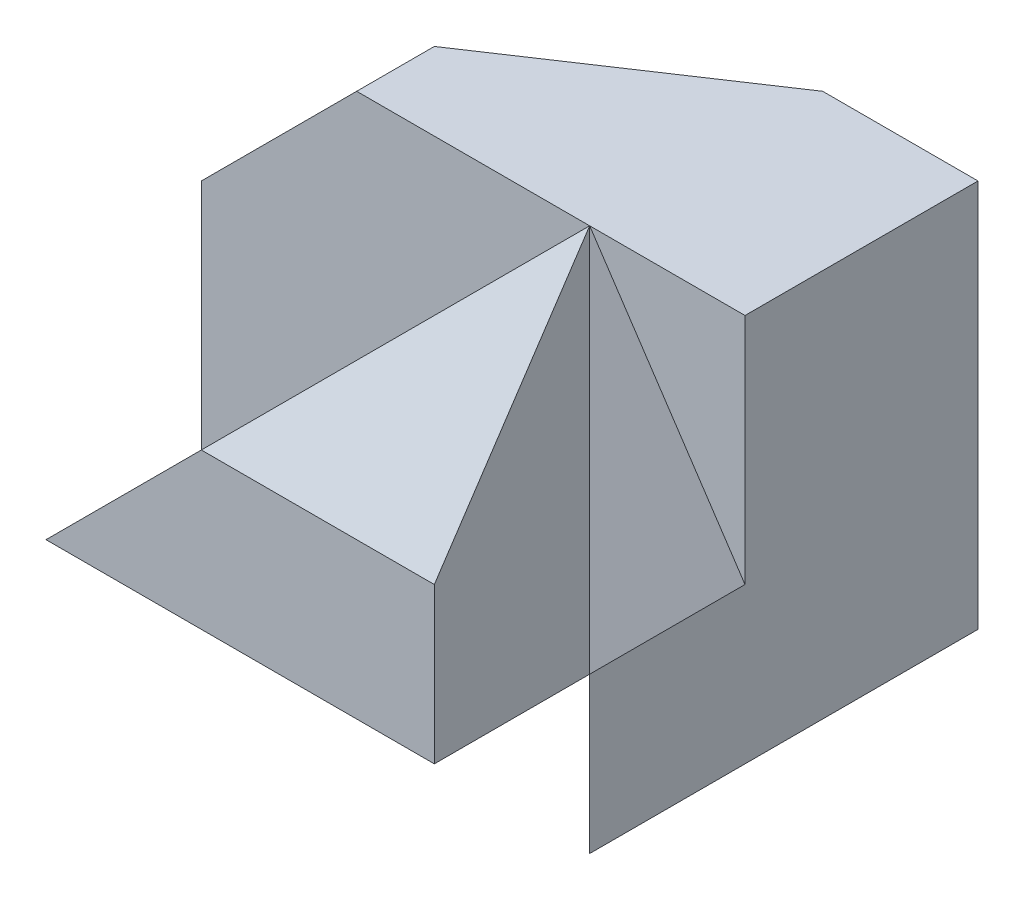
ISO-10303-21;
HEADER;
FILE_DESCRIPTION(('STEP AP214'),'2;1');
FILE_NAME('part.step','',(''),(''),'','','');
FILE_SCHEMA(('AUTOMOTIVE_DESIGN { 1 0 10303 214 1 1 1 1 }'));
ENDSEC;
DATA;
#1=APPLICATION_CONTEXT('core data for automotive mechanical design processes');
#2=APPLICATION_PROTOCOL_DEFINITION('international standard','automotive_design',2000,#1);
#3=PRODUCT_CONTEXT('',#1,'mechanical');
#4=PRODUCT('Part','Part','',(#3));
#5=PRODUCT_RELATED_PRODUCT_CATEGORY('part','',(#4));
#6=PRODUCT_DEFINITION_FORMATION('','',#4);
#7=PRODUCT_DEFINITION_CONTEXT('part definition',#1,'design');
#8=PRODUCT_DEFINITION('design','',#6,#7);
#9=PRODUCT_DEFINITION_SHAPE('','',#8);
#10=(LENGTH_UNIT() NAMED_UNIT(*) SI_UNIT(.MILLI.,.METRE.));
#11=(NAMED_UNIT(*) PLANE_ANGLE_UNIT() SI_UNIT($,.RADIAN.));
#12=(NAMED_UNIT(*) SI_UNIT($,.STERADIAN.) SOLID_ANGLE_UNIT());
#13=UNCERTAINTY_MEASURE_WITH_UNIT(LENGTH_MEASURE(1.E-05),#10,'distance_accuracy_value','');
#14=(GEOMETRIC_REPRESENTATION_CONTEXT(3) GLOBAL_UNCERTAINTY_ASSIGNED_CONTEXT((#13)) GLOBAL_UNIT_ASSIGNED_CONTEXT((#10,
#11,#12)) REPRESENTATION_CONTEXT('',''));
#15=CARTESIAN_POINT('',(0.,0.,0.));
#16=DIRECTION('',(0.,0.,1.));
#17=DIRECTION('',(1.,0.,0.));
#18=AXIS2_PLACEMENT_3D('',#15,#16,#17);
#19=CARTESIAN_POINT('',(20.,0.,0.));
#20=DIRECTION('',(0.,-0.554700196225229,0.832050294337844));
#21=DIRECTION('',(0.,-0.832050294337844,-0.554700196225229));
#22=AXIS2_PLACEMENT_3D('',#19,#20,#21);
#23=PLANE('',#22);
#24=DIRECTION('',(-1.,0.,0.));
#25=VECTOR('',#24,1.);
#26=CARTESIAN_POINT('',(20.,30.,20.));
#27=LINE('',#26,#25);
#28=CARTESIAN_POINT('',(20.,30.,20.));
#29=VERTEX_POINT('',#28);
#30=CARTESIAN_POINT('',(0.,30.,20.));
#31=VERTEX_POINT('',#30);
#32=EDGE_CURVE('E301',#29,#31,#27,.T.);
#33=ORIENTED_EDGE('',*,*,#32,.F.);
#34=CARTESIAN_POINT('',(20.,5.84616321716092E-05,-2.76923375251665E-05));
#35=DIRECTION('',(0.,0.832049440949972,0.554701476304902));
#36=VECTOR('',#35,1.);
#37=LINE('',#34,#36);
#38=CARTESIAN_POINT('',(19.9999999998504,0.,6.00005553251688E-05));
#39=VERTEX_POINT('',#38);
#40=EDGE_CURVE('E207',#39,#29,#37,.T.);
#41=ORIENTED_EDGE('',*,*,#40,.F.);
#42=CARTESIAN_POINT('',(4.72295226169299,0.,1.41689879204487E-05));
#43=DIRECTION('',(0.9999999999955,0.,3.0000277663376E-06));
#44=VECTOR('',#43,1.);
#45=LINE('',#42,#44);
#46=CARTESIAN_POINT('',(4.72295226171092,1.62768280284415E-06,8.18518395397015E-06));
#47=VERTEX_POINT('',#46);
#48=EDGE_CURVE('E45',#47,#39,#45,.T.);
#49=ORIENTED_EDGE('',*,*,#48,.F.);
#50=DIRECTION('',(-0.999999999998615,-1.3846148165639E-06,-9.23076544375934E-07));
#51=VECTOR('',#50,1.);
#52=CARTESIAN_POINT('',(1.1094003924198E-05,1.53601090180366E-11,1.02418074021671E-11));
#53=LINE('',#52,#51);
#54=CARTESIAN_POINT('',(0.,0.,0.));
#55=VERTEX_POINT('',#54);
#56=EDGE_CURVE('E234',#47,#55,#53,.T.);
#57=ORIENTED_EDGE('',*,*,#56,.T.);
#58=DIRECTION('',(0.,0.832050294337844,0.554700196225229));
#59=VECTOR('',#58,1.);
#60=CARTESIAN_POINT('',(0.,0.,0.));
#61=LINE('',#60,#59);
#62=EDGE_CURVE('E289',#55,#31,#61,.T.);
#63=ORIENTED_EDGE('',*,*,#62,.T.);
#64=EDGE_LOOP('',(#33,#41,#49,#57,#63));
#65=FACE_BOUND('',#64,.T.);
#66=ADVANCED_FACE('F36',(#65),#23,.F.);
#67=CARTESIAN_POINT('',(70.,0.,50.));
#68=DIRECTION('',(0.,1.,0.));
#69=DIRECTION('',(0.,0.,1.));
#70=AXIS2_PLACEMENT_3D('',#67,#68,#69);
#71=PLANE('',#70);
#72=ORIENTED_EDGE('',*,*,#48,.T.);
#73=DIRECTION('',(1.,0.,0.));
#74=VECTOR('',#73,1.);
#75=CARTESIAN_POINT('',(70.,0.,0.));
#76=LINE('',#75,#74);
#77=CARTESIAN_POINT('',(70.,0.,0.));
#78=VERTEX_POINT('',#77);
#79=EDGE_CURVE('E305',#39,#78,#76,.T.);
#80=ORIENTED_EDGE('',*,*,#79,.T.);
#81=DIRECTION('',(0.,0.,-1.));
#82=VECTOR('',#81,1.);
#83=CARTESIAN_POINT('',(70.,0.,50.));
#84=LINE('',#83,#82);
#85=CARTESIAN_POINT('',(70.,0.,50.));
#86=VERTEX_POINT('',#85);
#87=EDGE_CURVE('E742',#86,#78,#84,.T.);
#88=ORIENTED_EDGE('',*,*,#87,.F.);
#89=DIRECTION('',(0.707106781186548,0.,0.707106781186548));
#90=VECTOR('',#89,1.);
#91=CARTESIAN_POINT('',(70.,0.,50.));
#92=LINE('',#91,#90);
#93=CARTESIAN_POINT('',(50.,0.,30.));
#94=VERTEX_POINT('',#93);
#95=EDGE_CURVE('E338',#94,#86,#92,.T.);
#96=ORIENTED_EDGE('',*,*,#95,.F.);
#97=DIRECTION('',(0.,0.,1.));
#98=VECTOR('',#97,1.);
#99=CARTESIAN_POINT('',(50.,0.,40.));
#100=LINE('',#99,#98);
#101=CARTESIAN_POINT('',(50.,0.,50.));
#102=VERTEX_POINT('',#101);
#103=EDGE_CURVE('E343',#94,#102,#100,.T.);
#104=ORIENTED_EDGE('',*,*,#103,.T.);
#105=DIRECTION('',(-1.,0.,0.));
#106=VECTOR('',#105,1.);
#107=CARTESIAN_POINT('',(30.,0.,50.));
#108=LINE('',#107,#106);
#109=CARTESIAN_POINT('',(0.,0.,50.));
#110=VERTEX_POINT('',#109);
#111=EDGE_CURVE('E346',#102,#110,#108,.T.);
#112=ORIENTED_EDGE('',*,*,#111,.T.);
#113=DIRECTION('',(0.,0.,1.));
#114=VECTOR('',#113,1.);
#115=CARTESIAN_POINT('',(0.,0.,21.));
#116=LINE('',#115,#114);
#117=CARTESIAN_POINT('',(0.,0.,30.));
#118=VERTEX_POINT('',#117);
#119=EDGE_CURVE('E351',#118,#110,#116,.T.);
#120=ORIENTED_EDGE('',*,*,#119,.F.);
#121=DIRECTION('',(0.,0.,-1.));
#122=VECTOR('',#121,1.);
#123=CARTESIAN_POINT('',(0.,0.,50.));
#124=LINE('',#123,#122);
#125=EDGE_CURVE('E361',#118,#55,#124,.T.);
#126=ORIENTED_EDGE('',*,*,#125,.T.);
#127=ORIENTED_EDGE('',*,*,#56,.F.);
#128=EDGE_LOOP('',(#72,#80,#88,#96,#104,#112,#120,#126,#127));
#129=FACE_BOUND('',#128,.T.);
#130=ADVANCED_FACE('F186',(#129),#71,.F.);
#131=CARTESIAN_POINT('',(15.3846153846154,40.,23.0769230769231));
#132=DIRECTION('',(0.554700196225229,0.,0.832050294337844));
#133=DIRECTION('',(0.832050294337844,0.,-0.554700196225229));
#134=AXIS2_PLACEMENT_3D('',#131,#132,#133);
#135=PLANE('',#134);
#136=DIRECTION('',(0.,1.,0.));
#137=VECTOR('',#136,1.);
#138=CARTESIAN_POINT('',(50.,40.,0.));
#139=LINE('',#138,#137);
#140=CARTESIAN_POINT('',(50.,0.0001,0.));
#141=VERTEX_POINT('',#140);
#142=CARTESIAN_POINT('',(50.,50.,0.));
#143=VERTEX_POINT('',#142);
#144=EDGE_CURVE('E245',#141,#143,#139,.T.);
#145=ORIENTED_EDGE('',*,*,#144,.F.);
#146=DIRECTION('',(-0.63960302125191,0.63960088924184,0.42640201416794));
#147=VECTOR('',#146,1.);
#148=CARTESIAN_POINT('',(50.,0.0001,0.));
#149=LINE('',#148,#147);
#150=EDGE_CURVE('E367',#141,#29,#149,.T.);
#151=ORIENTED_EDGE('',*,*,#150,.T.);
#152=DIRECTION('',(0.,1.,0.));
#153=VECTOR('',#152,1.);
#154=CARTESIAN_POINT('',(20.,30.,20.));
#155=LINE('',#154,#153);
#156=CARTESIAN_POINT('',(20.,50.,20.));
#157=VERTEX_POINT('',#156);
#158=EDGE_CURVE('E311',#29,#157,#155,.T.);
#159=ORIENTED_EDGE('',*,*,#158,.T.);
#160=DIRECTION('',(0.832050294337844,0.,-0.554700196225229));
#161=VECTOR('',#160,1.);
#162=CARTESIAN_POINT('',(15.3846153846154,50.,23.0769230769231));
#163=LINE('',#162,#161);
#164=EDGE_CURVE('E374',#157,#143,#163,.T.);
#165=ORIENTED_EDGE('',*,*,#164,.T.);
#166=EDGE_LOOP('',(#145,#151,#159,#165));
#167=FACE_BOUND('',#166,.T.);
#168=ADVANCED_FACE('F405',(#167),#135,.F.);
#169=CARTESIAN_POINT('',(50.,50.,20.));
#170=DIRECTION('',(-0.832050294337843,-0.55470019622523,0.));
#171=DIRECTION('',(0.55470019622523,-0.832050294337843,0.));
#172=AXIS2_PLACEMENT_3D('',#169,#170,#171);
#173=PLANE('',#172);
#174=DIRECTION('',(0.55470019622523,-0.832050294337843,0.));
#175=VECTOR('',#174,1.);
#176=CARTESIAN_POINT('',(50.,50.,29.999));
#177=LINE('',#176,#175);
#178=CARTESIAN_POINT('',(50.,50.,29.999));
#179=VERTEX_POINT('',#178);
#180=CARTESIAN_POINT('',(70.,20.,29.999));
#181=VERTEX_POINT('',#180);
#182=EDGE_CURVE('E335',#179,#181,#177,.T.);
#183=ORIENTED_EDGE('',*,*,#182,.F.);
#184=DIRECTION('',(0.,0.,1.));
#185=VECTOR('',#184,1.);
#186=CARTESIAN_POINT('',(50.,50.,20.));
#187=LINE('',#186,#185);
#188=CARTESIAN_POINT('',(50.,50.,30.));
#189=VERTEX_POINT('',#188);
#190=EDGE_CURVE('E357',#179,#189,#187,.T.);
#191=ORIENTED_EDGE('',*,*,#190,.T.);
#192=DIRECTION('',(-0.485071250072666,0.727606875108999,-0.485071250072666));
#193=VECTOR('',#192,1.);
#194=CARTESIAN_POINT('',(59.4117647058824,35.8823529411765,39.4117647058824));
#195=LINE('',#194,#193);
#196=CARTESIAN_POINT('',(70.,20.,50.));
#197=VERTEX_POINT('',#196);
#198=EDGE_CURVE('E731',#197,#189,#195,.T.);
#199=ORIENTED_EDGE('',*,*,#198,.F.);
#200=DIRECTION('',(0.,0.,1.));
#201=VECTOR('',#200,1.);
#202=CARTESIAN_POINT('',(70.,20.,20.));
#203=LINE('',#202,#201);
#204=EDGE_CURVE('E737',#181,#197,#203,.T.);
#205=ORIENTED_EDGE('',*,*,#204,.F.);
#206=EDGE_LOOP('',(#183,#191,#199,#205));
#207=FACE_BOUND('',#206,.T.);
#208=ADVANCED_FACE('F411',(#207),#173,.F.);
#209=CARTESIAN_POINT('',(20.,20.,21.));
#210=DIRECTION('',(-0.707106781186547,0.707106781186547,0.));
#211=DIRECTION('',(-0.707106781186547,-0.707106781186548,0.));
#212=AXIS2_PLACEMENT_3D('',#209,#210,#211);
#213=PLANE('',#212);
#214=DIRECTION('',(-0.639602149066831,-0.639602149066831,0.426401432711221));
#215=VECTOR('',#214,1.);
#216=CARTESIAN_POINT('',(31.8636363636364,31.8636363636364,42.0909090909091));
#217=LINE('',#216,#215);
#218=CARTESIAN_POINT('',(20.,20.,50.));
#219=VERTEX_POINT('',#218);
#220=EDGE_CURVE('E319',#189,#219,#217,.T.);
#221=ORIENTED_EDGE('',*,*,#220,.F.);
#222=DIRECTION('',(-0.707106781186547,-0.707106781186548,0.));
#223=VECTOR('',#222,1.);
#224=CARTESIAN_POINT('',(30.,30.,30.));
#225=LINE('',#224,#223);
#226=EDGE_CURVE('E355',#189,#118,#225,.T.);
#227=ORIENTED_EDGE('',*,*,#226,.T.);
#228=ORIENTED_EDGE('',*,*,#119,.T.);
#229=DIRECTION('',(-0.707106781186548,-0.707106781186548,0.));
#230=VECTOR('',#229,1.);
#231=CARTESIAN_POINT('',(20.,20.,50.));
#232=LINE('',#231,#230);
#233=EDGE_CURVE('E347',#219,#110,#232,.T.);
#234=ORIENTED_EDGE('',*,*,#233,.F.);
#235=EDGE_LOOP('',(#221,#227,#228,#234));
#236=FACE_BOUND('',#235,.T.);
#237=ADVANCED_FACE('F414',(#236),#213,.T.);
#238=CARTESIAN_POINT('',(70.,50.,50.));
#239=DIRECTION('',(-1.,0.,0.));
#240=DIRECTION('',(0.,0.,1.));
#241=AXIS2_PLACEMENT_3D('',#238,#239,#240);
#242=PLANE('',#241);
#243=DIRECTION('',(0.,0.,-1.));
#244=VECTOR('',#243,1.);
#245=CARTESIAN_POINT('',(70.,50.,50.));
#246=LINE('',#245,#244);
#247=CARTESIAN_POINT('',(70.,50.,29.999));
#248=VERTEX_POINT('',#247);
#249=CARTESIAN_POINT('',(70.,50.,0.));
#250=VERTEX_POINT('',#249);
#251=EDGE_CURVE('E747',#248,#250,#246,.T.);
#252=ORIENTED_EDGE('',*,*,#251,.F.);
#253=DIRECTION('',(0.,-1.,0.));
#254=VECTOR('',#253,1.);
#255=CARTESIAN_POINT('',(70.,50.,29.999));
#256=LINE('',#255,#254);
#257=EDGE_CURVE('E354',#248,#181,#256,.T.);
#258=ORIENTED_EDGE('',*,*,#257,.T.);
#259=ORIENTED_EDGE('',*,*,#204,.T.);
#260=DIRECTION('',(0.,-1.,0.));
#261=VECTOR('',#260,1.);
#262=CARTESIAN_POINT('',(70.,50.,50.));
#263=LINE('',#262,#261);
#264=EDGE_CURVE('E739',#197,#86,#263,.T.);
#265=ORIENTED_EDGE('',*,*,#264,.T.);
#266=ORIENTED_EDGE('',*,*,#87,.T.);
#267=DIRECTION('',(0.,1.,0.));
#268=VECTOR('',#267,1.);
#269=CARTESIAN_POINT('',(70.,50.,0.));
#270=LINE('',#269,#268);
#271=EDGE_CURVE('E292',#78,#250,#270,.T.);
#272=ORIENTED_EDGE('',*,*,#271,.T.);
#273=EDGE_LOOP('',(#252,#258,#259,#265,#266,#272));
#274=FACE_BOUND('',#273,.T.);
#275=ADVANCED_FACE('F264',(#274),#242,.F.);
#276=CARTESIAN_POINT('',(0.,0.,50.));
#277=DIRECTION('',(1.,0.,0.));
#278=DIRECTION('',(0.,0.,-1.));
#279=AXIS2_PLACEMENT_3D('',#276,#277,#278);
#280=PLANE('',#279);
#281=ORIENTED_EDGE('',*,*,#62,.F.);
#282=ORIENTED_EDGE('',*,*,#125,.F.);
#283=DIRECTION('',(0.,1.,0.));
#284=VECTOR('',#283,1.);
#285=CARTESIAN_POINT('',(0.,50.,30.));
#286=LINE('',#285,#284);
#287=CARTESIAN_POINT('',(0.,30.,30.));
#288=VERTEX_POINT('',#287);
#289=EDGE_CURVE('E291',#118,#288,#286,.T.);
#290=ORIENTED_EDGE('',*,*,#289,.T.);
#291=DIRECTION('',(0.,0.,1.));
#292=VECTOR('',#291,1.);
#293=CARTESIAN_POINT('',(0.,30.,20.));
#294=LINE('',#293,#292);
#295=EDGE_CURVE('E294',#31,#288,#294,.T.);
#296=ORIENTED_EDGE('',*,*,#295,.F.);
#297=EDGE_LOOP('',(#281,#282,#290,#296));
#298=FACE_BOUND('',#297,.T.);
#299=ADVANCED_FACE('F260',(#298),#280,.F.);
#300=CARTESIAN_POINT('',(0.,0.,50.));
#301=DIRECTION('',(0.,0.,-1.));
#302=DIRECTION('',(-1.,0.,0.));
#303=AXIS2_PLACEMENT_3D('',#300,#301,#302);
#304=PLANE('',#303);
#305=ORIENTED_EDGE('',*,*,#233,.T.);
#306=ORIENTED_EDGE('',*,*,#111,.F.);
#307=DIRECTION('',(0.,-1.,0.));
#308=VECTOR('',#307,1.);
#309=CARTESIAN_POINT('',(50.,0.,50.));
#310=LINE('',#309,#308);
#311=CARTESIAN_POINT('',(50.,20.,50.));
#312=VERTEX_POINT('',#311);
#313=EDGE_CURVE('E341',#312,#102,#310,.T.);
#314=ORIENTED_EDGE('',*,*,#313,.F.);
#315=DIRECTION('',(1.,0.,0.));
#316=VECTOR('',#315,1.);
#317=CARTESIAN_POINT('',(50.,20.,50.));
#318=LINE('',#317,#316);
#319=EDGE_CURVE('E317',#219,#312,#318,.T.);
#320=ORIENTED_EDGE('',*,*,#319,.F.);
#321=EDGE_LOOP('',(#305,#306,#314,#320));
#322=FACE_BOUND('',#321,.T.);
#323=ADVANCED_FACE('F190',(#322),#304,.F.);
#324=CARTESIAN_POINT('',(20.,50.,50.));
#325=DIRECTION('',(0.,-1.,0.));
#326=DIRECTION('',(0.,0.,-1.));
#327=AXIS2_PLACEMENT_3D('',#324,#325,#326);
#328=PLANE('',#327);
#329=DIRECTION('',(-1.,0.,0.));
#330=VECTOR('',#329,1.);
#331=CARTESIAN_POINT('',(20.,50.,0.));
#332=LINE('',#331,#330);
#333=EDGE_CURVE('E350',#250,#143,#332,.T.);
#334=ORIENTED_EDGE('',*,*,#333,.T.);
#335=ORIENTED_EDGE('',*,*,#164,.F.);
#336=DIRECTION('',(0.,0.,-1.));
#337=VECTOR('',#336,1.);
#338=CARTESIAN_POINT('',(20.,50.,30.));
#339=LINE('',#338,#337);
#340=CARTESIAN_POINT('',(20.,50.,30.));
#341=VERTEX_POINT('',#340);
#342=EDGE_CURVE('E316',#341,#157,#339,.T.);
#343=ORIENTED_EDGE('',*,*,#342,.F.);
#344=DIRECTION('',(-1.,0.,0.));
#345=VECTOR('',#344,1.);
#346=CARTESIAN_POINT('',(72.,50.,30.));
#347=LINE('',#346,#345);
#348=EDGE_CURVE('E246',#189,#341,#347,.T.);
#349=ORIENTED_EDGE('',*,*,#348,.F.);
#350=ORIENTED_EDGE('',*,*,#190,.F.);
#351=DIRECTION('',(1.,0.,0.));
#352=VECTOR('',#351,1.);
#353=CARTESIAN_POINT('',(50.,50.,29.999));
#354=LINE('',#353,#352);
#355=EDGE_CURVE('E385',#179,#248,#354,.T.);
#356=ORIENTED_EDGE('',*,*,#355,.T.);
#357=ORIENTED_EDGE('',*,*,#251,.T.);
#358=EDGE_LOOP('',(#334,#335,#343,#349,#350,#356,#357));
#359=FACE_BOUND('',#358,.T.);
#360=ADVANCED_FACE('F258',(#359),#328,.F.);
#361=CARTESIAN_POINT('',(0.,0.,0.));
#362=DIRECTION('',(0.,0.,-1.));
#363=DIRECTION('',(-1.,0.,0.));
#364=AXIS2_PLACEMENT_3D('',#361,#362,#363);
#365=PLANE('',#364);
#366=CARTESIAN_POINT('',(20.,3.99999999990225E-05,0.));
#367=DIRECTION('',(0.999999999998,1.99999999994713E-06,0.));
#368=VECTOR('',#367,1.);
#369=LINE('',#366,#368);
#370=EDGE_CURVE('E242',#39,#141,#369,.T.);
#371=ORIENTED_EDGE('',*,*,#370,.T.);
#372=ORIENTED_EDGE('',*,*,#144,.T.);
#373=ORIENTED_EDGE('',*,*,#333,.F.);
#374=ORIENTED_EDGE('',*,*,#271,.F.);
#375=ORIENTED_EDGE('',*,*,#79,.F.);
#376=EDGE_LOOP('',(#371,#372,#373,#374,#375));
#377=FACE_BOUND('',#376,.T.);
#378=ADVANCED_FACE('F249',(#377),#365,.T.);
#379=CARTESIAN_POINT('',(10.,50.,30.));
#380=DIRECTION('',(0.,0.,1.));
#381=DIRECTION('',(0.,-1.,0.));
#382=AXIS2_PLACEMENT_3D('',#379,#380,#381);
#383=PLANE('',#382);
#384=ORIENTED_EDGE('',*,*,#226,.F.);
#385=ORIENTED_EDGE('',*,*,#348,.T.);
#386=DIRECTION('',(0.707106781186548,0.707106781186548,0.));
#387=VECTOR('',#386,1.);
#388=CARTESIAN_POINT('',(-15.,15.,30.));
#389=LINE('',#388,#387);
#390=EDGE_CURVE('E300',#288,#341,#389,.T.);
#391=ORIENTED_EDGE('',*,*,#390,.F.);
#392=ORIENTED_EDGE('',*,*,#289,.F.);
#393=EDGE_LOOP('',(#384,#385,#391,#392));
#394=FACE_BOUND('',#393,.T.);
#395=ADVANCED_FACE('F188',(#394),#383,.T.);
#396=CARTESIAN_POINT('',(50.,0.,40.));
#397=DIRECTION('',(-1.,0.,0.));
#398=DIRECTION('',(0.,-1.,0.));
#399=AXIS2_PLACEMENT_3D('',#396,#397,#398);
#400=PLANE('',#399);
#401=ORIENTED_EDGE('',*,*,#103,.F.);
#402=DIRECTION('',(0.,-1.,0.));
#403=VECTOR('',#402,1.);
#404=CARTESIAN_POINT('',(50.,0.,30.));
#405=LINE('',#404,#403);
#406=EDGE_CURVE('E728',#189,#94,#405,.T.);
#407=ORIENTED_EDGE('',*,*,#406,.F.);
#408=DIRECTION('',(0.,0.832050294337844,-0.554700196225229));
#409=VECTOR('',#408,1.);
#410=CARTESIAN_POINT('',(50.,20.,50.));
#411=LINE('',#410,#409);
#412=EDGE_CURVE('E339',#312,#189,#411,.T.);
#413=ORIENTED_EDGE('',*,*,#412,.F.);
#414=ORIENTED_EDGE('',*,*,#313,.T.);
#415=EDGE_LOOP('',(#401,#407,#413,#414));
#416=FACE_BOUND('',#415,.T.);
#417=ADVANCED_FACE('F409',(#416),#400,.F.);
#418=CARTESIAN_POINT('',(49.,20.,50.));
#419=DIRECTION('',(0.,-0.554700196225229,-0.832050294337844));
#420=DIRECTION('',(0.,0.832050294337844,-0.554700196225229));
#421=AXIS2_PLACEMENT_3D('',#418,#419,#420);
#422=PLANE('',#421);
#423=ORIENTED_EDGE('',*,*,#412,.T.);
#424=ORIENTED_EDGE('',*,*,#220,.T.);
#425=ORIENTED_EDGE('',*,*,#319,.T.);
#426=EDGE_LOOP('',(#423,#424,#425));
#427=FACE_BOUND('',#426,.T.);
#428=ADVANCED_FACE('F406',(#427),#422,.F.);
#429=CARTESIAN_POINT('',(0.,0.,20.));
#430=DIRECTION('',(0.,0.,1.));
#431=DIRECTION('',(1.,0.,0.));
#432=AXIS2_PLACEMENT_3D('',#429,#430,#431);
#433=PLANE('',#432);
#434=DIRECTION('',(0.707106781186548,0.707106781186548,0.));
#435=VECTOR('',#434,1.);
#436=CARTESIAN_POINT('',(-15.,15.,20.));
#437=LINE('',#436,#435);
#438=EDGE_CURVE('E310',#31,#157,#437,.T.);
#439=ORIENTED_EDGE('',*,*,#438,.T.);
#440=ORIENTED_EDGE('',*,*,#158,.F.);
#441=ORIENTED_EDGE('',*,*,#32,.T.);
#442=EDGE_LOOP('',(#439,#440,#441));
#443=FACE_BOUND('',#442,.T.);
#444=ADVANCED_FACE('F309',(#443),#433,.F.);
#445=CARTESIAN_POINT('',(-15.,15.,30.));
#446=DIRECTION('',(-0.707106781186548,0.707106781186548,0.));
#447=DIRECTION('',(-0.707106781186548,-0.707106781186548,0.));
#448=AXIS2_PLACEMENT_3D('',#445,#446,#447);
#449=PLANE('',#448);
#450=ORIENTED_EDGE('',*,*,#438,.F.);
#451=ORIENTED_EDGE('',*,*,#295,.T.);
#452=ORIENTED_EDGE('',*,*,#390,.T.);
#453=ORIENTED_EDGE('',*,*,#342,.T.);
#454=EDGE_LOOP('',(#450,#451,#452,#453));
#455=FACE_BOUND('',#454,.T.);
#456=ADVANCED_FACE('F314',(#455),#449,.T.);
#457=CARTESIAN_POINT('',(70.,50.,50.));
#458=DIRECTION('',(0.707106781186548,0.,-0.707106781186548));
#459=DIRECTION('',(-0.707106781186548,0.,-0.707106781186548));
#460=AXIS2_PLACEMENT_3D('',#457,#458,#459);
#461=PLANE('',#460);
#462=ORIENTED_EDGE('',*,*,#264,.F.);
#463=ORIENTED_EDGE('',*,*,#198,.T.);
#464=ORIENTED_EDGE('',*,*,#406,.T.);
#465=ORIENTED_EDGE('',*,*,#95,.T.);
#466=EDGE_LOOP('',(#462,#463,#464,#465));
#467=FACE_BOUND('',#466,.T.);
#468=ADVANCED_FACE('F418',(#467),#461,.F.);
#469=CARTESIAN_POINT('',(50.,50.,29.999));
#470=DIRECTION('',(0.,0.,-1.));
#471=DIRECTION('',(-1.,0.,0.));
#472=AXIS2_PLACEMENT_3D('',#469,#470,#471);
#473=PLANE('',#472);
#474=ORIENTED_EDGE('',*,*,#355,.F.);
#475=ORIENTED_EDGE('',*,*,#182,.T.);
#476=ORIENTED_EDGE('',*,*,#257,.F.);
#477=EDGE_LOOP('',(#474,#475,#476));
#478=FACE_BOUND('',#477,.T.);
#479=ADVANCED_FACE('F224',(#478),#473,.F.);
#480=CARTESIAN_POINT('',(0.,3.07693727807673E-05,-4.61539053242871E-05));
#481=DIRECTION('',(0.,0.554701476304903,-0.832049440949973));
#482=DIRECTION('',(0.,0.832049440949973,0.554701476304903));
#483=AXIS2_PLACEMENT_3D('',#480,#481,#482);
#484=PLANE('',#483);
#485=ORIENTED_EDGE('',*,*,#370,.F.);
#486=ORIENTED_EDGE('',*,*,#40,.T.);
#487=ORIENTED_EDGE('',*,*,#150,.F.);
#488=EDGE_LOOP('',(#485,#486,#487));
#489=FACE_BOUND('',#488,.T.);
#490=ADVANCED_FACE('F214',(#489),#484,.T.);
#491=CLOSED_SHELL('',(#66,#130,#168,#208,#237,#275,#299,#323,#360,#378,#395,#417,#428,#444,#456,
#468,#479,#490));
#492=CARTESIAN_POINT('',(20.,0.,0.));
#493=DIRECTION('',(-1.,0.,0.));
#494=DIRECTION('',(0.,0.,1.));
#495=AXIS2_PLACEMENT_3D('',#492,#493,#494);
#496=PLANE('',#495);
#497=DIRECTION('',(0.,1.,0.));
#498=VECTOR('',#497,1.);
#499=CARTESIAN_POINT('',(20.,0.,20.));
#500=LINE('',#499,#498);
#501=CARTESIAN_POINT('',(20.,1.,20.));
#502=VERTEX_POINT('',#501);
#503=CARTESIAN_POINT('',(20.,11.9722602636714,20.));
#504=VERTEX_POINT('',#503);
#505=EDGE_CURVE('E158',#502,#504,#500,.T.);
#506=ORIENTED_EDGE('',*,*,#505,.F.);
#507=DIRECTION('',(0.,0.,-1.));
#508=VECTOR('',#507,1.);
#509=CARTESIAN_POINT('',(20.,1.,0.));
#510=LINE('',#509,#508);
#511=CARTESIAN_POINT('',(20.,1.,12.6852309180507));
#512=VERTEX_POINT('',#511);
#513=EDGE_CURVE('E162',#502,#512,#510,.T.);
#514=ORIENTED_EDGE('',*,*,#513,.T.);
#515=DIRECTION('',(0.,0.832050294337843,0.55470019622523));
#516=VECTOR('',#515,1.);
#517=CARTESIAN_POINT('',(20.,-5.54702965448497,8.32054448172742));
#518=LINE('',#517,#516);
#519=CARTESIAN_POINT('',(20.,2.77349664820315,13.8675620168528));
#520=VERTEX_POINT('',#519);
#521=EDGE_CURVE('E150',#512,#520,#518,.T.);
#522=ORIENTED_EDGE('',*,*,#521,.T.);
#523=DIRECTION('',(0.,0.554700196221413,-0.832050294340388));
#524=VECTOR('',#523,1.);
#525=CARTESIAN_POINT('',(20.,8.32052630267538,5.54701753506181));
#526=LINE('',#525,#524);
#527=CARTESIAN_POINT('',(20.,2.77353323458261,13.8675071372836));
#528=VERTEX_POINT('',#527);
#529=EDGE_CURVE('E166',#520,#528,#526,.T.);
#530=ORIENTED_EDGE('',*,*,#529,.T.);
#531=DIRECTION('',(0.,0.832049952983404,0.554700708256547));
#532=VECTOR('',#531,1.);
#533=CARTESIAN_POINT('',(20.,-5.54699477485387,8.32048106829122));
#534=LINE('',#533,#532);
#535=EDGE_CURVE('E159',#528,#504,#534,.T.);
#536=ORIENTED_EDGE('',*,*,#535,.T.);
#537=EDGE_LOOP('',(#506,#514,#522,#530,#536));
#538=FACE_BOUND('',#537,.T.);
#539=ADVANCED_FACE('F163',(#538),#496,.F.);
#540=DIRECTION('',(0.639600971621948,-0.639603849816725,-0.426400647747965));
#541=VECTOR('',#540,1.);
#542=CARTESIAN_POINT('',(5.80679077868281,26.1654267134696,29.4621394808781));
#543=LINE('',#542,#541);
#544=CARTESIAN_POINT('',(29.198614252521,2.77349797677677,13.8675904983194));
#545=VERTEX_POINT('',#544);
#546=CARTESIAN_POINT('',(30.9721042486194,0.999999999999999,12.6852638342538));
#547=VERTEX_POINT('',#546);
#548=EDGE_CURVE('E332',#545,#547,#543,.T.);
#549=ORIENTED_EDGE('',*,*,#548,.T.);
#550=DIRECTION('',(-0.832050294337844,0.,0.554700196225229));
#551=VECTOR('',#550,1.);
#552=CARTESIAN_POINT('',(15.3846153846154,1.,23.0769230769231));
#553=LINE('',#552,#551);
#554=EDGE_CURVE('E52',#547,#502,#553,.T.);
#555=ORIENTED_EDGE('',*,*,#554,.T.);
#556=ORIENTED_EDGE('',*,*,#505,.T.);
#557=DIRECTION('',(0.63960302125191,-0.63960088924184,-0.42640201416794));
#558=VECTOR('',#557,1.);
#559=CARTESIAN_POINT('',(5.80683325530226,26.1653796978134,29.4621111631318));
#560=LINE('',#559,#558);
#561=CARTESIAN_POINT('',(29.1987379655243,2.77355296060703,13.8675080229838));
#562=VERTEX_POINT('',#561);
#563=EDGE_CURVE('E333',#504,#562,#560,.T.);
#564=ORIENTED_EDGE('',*,*,#563,.T.);
#565=DIRECTION('',(-0.780398506032845,-0.346845504057185,0.520265670688563));
#566=VECTOR('',#565,1.);
#567=CARTESIAN_POINT('',(27.1228488022478,1.85093096987096,15.2514341318348));
#568=LINE('',#567,#566);
#569=EDGE_CURVE('E330',#562,#545,#568,.T.);
#570=ORIENTED_EDGE('',*,*,#569,.T.);
#571=EDGE_LOOP('',(#549,#555,#556,#564,#570));
#572=FACE_BOUND('',#571,.T.);
#573=ADVANCED_FACE('F427',(#572),#135,.F.);
#574=CARTESIAN_POINT('',(-2.49614256232378E-05,-5.54700196223502,8.32050294335251));
#575=DIRECTION('',(-2.49614256232378E-06,-0.554700196223502,0.832050294335251));
#576=DIRECTION('',(0.,0.832050294337843,0.55470019622523));
#577=AXIS2_PLACEMENT_3D('',#574,#575,#576);
#578=PLANE('',#577);
#579=DIRECTION('',(-0.9999999999955,0.,-2.99998999977133E-06));
#580=VECTOR('',#579,1.);
#581=CARTESIAN_POINT('',(-3.80553858999711E-05,1.,12.6851709181366));
#582=LINE('',#581,#580);
#583=EDGE_CURVE('E11',#547,#512,#582,.T.);
#584=ORIENTED_EDGE('',*,*,#583,.F.);
#585=ORIENTED_EDGE('',*,*,#548,.F.);
#586=DIRECTION('',(0.999999999995196,1.44431930905592E-07,3.09627795370748E-06));
#587=VECTOR('',#586,1.);
#588=CARTESIAN_POINT('',(4.72290949093714,2.77349444170346,13.8675147147343));
#589=LINE('',#588,#587);
#590=EDGE_CURVE('E154',#520,#545,#589,.T.);
#591=ORIENTED_EDGE('',*,*,#590,.F.);
#592=ORIENTED_EDGE('',*,*,#521,.F.);
#593=EDGE_LOOP('',(#584,#585,#591,#592));
#594=FACE_BOUND('',#593,.T.);
#595=ADVANCED_FACE('F152',(#594),#578,.T.);
#596=CARTESIAN_POINT('',(4.72290949093714,2.77349444170346,13.8675147147343));
#597=DIRECTION('',(-1.83768061910545E-06,0.832050294338983,0.554700196220476));
#598=DIRECTION('',(0.,-0.554700196221413,0.832050294340388));
#599=AXIS2_PLACEMENT_3D('',#596,#597,#598);
#600=PLANE('',#599);
#601=DIRECTION('',(0.999999999997696,2.14442725613634E-06,9.62849658398344E-08));
#602=VECTOR('',#601,1.);
#603=CARTESIAN_POINT('',(4.72290949092508,2.77350047397333,13.8675056663295));
#604=LINE('',#603,#602);
#605=EDGE_CURVE('E277',#528,#562,#604,.T.);
#606=ORIENTED_EDGE('',*,*,#605,.F.);
#607=ORIENTED_EDGE('',*,*,#529,.F.);
#608=ORIENTED_EDGE('',*,*,#590,.T.);
#609=ORIENTED_EDGE('',*,*,#569,.F.);
#610=EDGE_LOOP('',(#606,#607,#608,#609));
#611=FACE_BOUND('',#610,.T.);
#612=ADVANCED_FACE('F227',(#611),#600,.T.);
#613=CARTESIAN_POINT('',(1.1094014164853E-05,-5.54700708256206,8.32049952982892));
#614=DIRECTION('',(1.1094014164853E-06,-0.554700708256206,0.832049952982892));
#615=DIRECTION('',(0.,-0.832049952983404,-0.554700708256547));
#616=AXIS2_PLACEMENT_3D('',#613,#614,#615);
#617=PLANE('',#616);
#618=ORIENTED_EDGE('',*,*,#535,.F.);
#619=ORIENTED_EDGE('',*,*,#605,.T.);
#620=ORIENTED_EDGE('',*,*,#563,.F.);
#621=EDGE_LOOP('',(#618,#619,#620));
#622=FACE_BOUND('',#621,.T.);
#623=ADVANCED_FACE('F38',(#622),#617,.T.);
#624=CARTESIAN_POINT('',(0.,1.,0.));
#625=DIRECTION('',(0.,1.,0.));
#626=DIRECTION('',(0.,0.,1.));
#627=AXIS2_PLACEMENT_3D('',#624,#625,#626);
#628=PLANE('',#627);
#629=ORIENTED_EDGE('',*,*,#513,.F.);
#630=ORIENTED_EDGE('',*,*,#554,.F.);
#631=ORIENTED_EDGE('',*,*,#583,.T.);
#632=EDGE_LOOP('',(#629,#630,#631));
#633=FACE_BOUND('',#632,.T.);
#634=ADVANCED_FACE('F168',(#633),#628,.T.);
#635=CLOSED_SHELL('',(#539,#573,#595,#612,#623,#634));
#636=ORIENTED_CLOSED_SHELL('',*,#635,.T.);
#637=BREP_WITH_VOIDS('B2',#491,(#636));
#638=ADVANCED_BREP_SHAPE_REPRESENTATION('',(#18,#637),#14);
#639=SHAPE_DEFINITION_REPRESENTATION(#9,#638);
ENDSEC;
END-ISO-10303-21;
